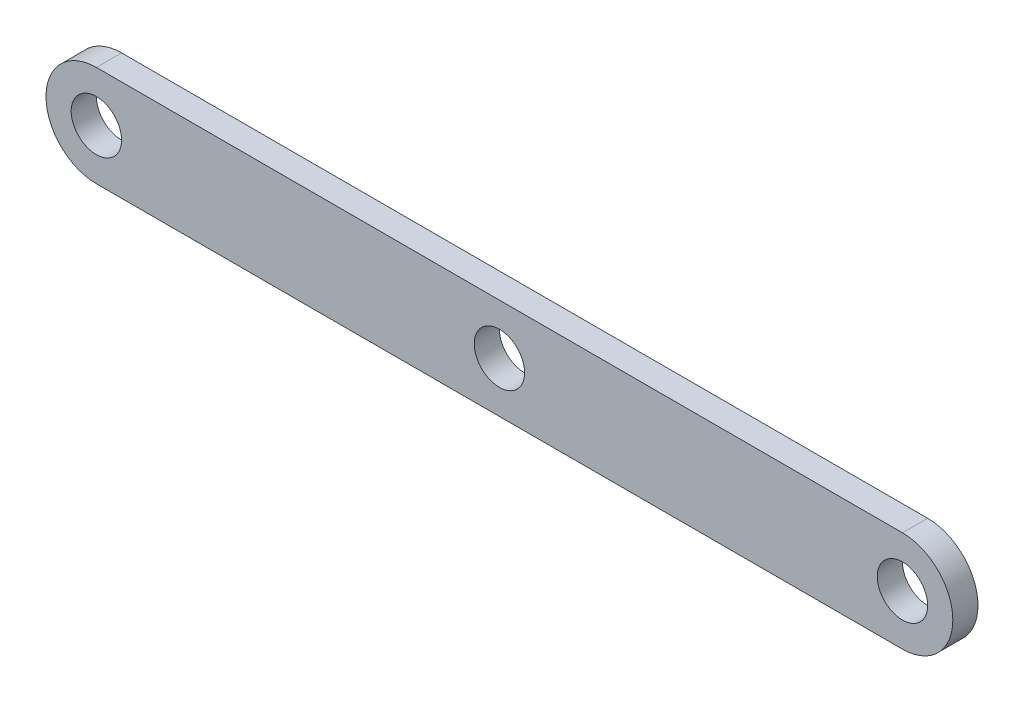
ISO-10303-21;
HEADER;
FILE_DESCRIPTION(('STEP AP214'),'2;1');
FILE_NAME('part.step','',(''),(''),'','','');
FILE_SCHEMA(('AUTOMOTIVE_DESIGN { 1 0 10303 214 1 1 1 1 }'));
ENDSEC;
DATA;
#1=APPLICATION_CONTEXT('core data for automotive mechanical design processes');
#2=APPLICATION_PROTOCOL_DEFINITION('international standard','automotive_design',2000,#1);
#3=PRODUCT_CONTEXT('',#1,'mechanical');
#4=PRODUCT('Part','Part','',(#3));
#5=PRODUCT_RELATED_PRODUCT_CATEGORY('part','',(#4));
#6=PRODUCT_DEFINITION_FORMATION('','',#4);
#7=PRODUCT_DEFINITION_CONTEXT('part definition',#1,'design');
#8=PRODUCT_DEFINITION('design','',#6,#7);
#9=PRODUCT_DEFINITION_SHAPE('','',#8);
#10=(LENGTH_UNIT() NAMED_UNIT(*) SI_UNIT(.MILLI.,.METRE.));
#11=(NAMED_UNIT(*) PLANE_ANGLE_UNIT() SI_UNIT($,.RADIAN.));
#12=(NAMED_UNIT(*) SI_UNIT($,.STERADIAN.) SOLID_ANGLE_UNIT());
#13=UNCERTAINTY_MEASURE_WITH_UNIT(LENGTH_MEASURE(1.E-05),#10,'distance_accuracy_value','');
#14=(GEOMETRIC_REPRESENTATION_CONTEXT(3) GLOBAL_UNCERTAINTY_ASSIGNED_CONTEXT((#13)) GLOBAL_UNIT_ASSIGNED_CONTEXT((#10,
#11,#12)) REPRESENTATION_CONTEXT('',''));
#15=CARTESIAN_POINT('',(0.,0.,0.));
#16=DIRECTION('',(0.,0.,1.));
#17=DIRECTION('',(1.,0.,0.));
#18=AXIS2_PLACEMENT_3D('',#15,#16,#17);
#19=CARTESIAN_POINT('',(0.,0.,3.175));
#20=DIRECTION('',(0.,0.,1.));
#21=DIRECTION('',(1.,0.,0.));
#22=AXIS2_PLACEMENT_3D('',#19,#20,#21);
#23=PLANE('',#22);
#24=CARTESIAN_POINT('',(101.6,0.,3.175));
#25=DIRECTION('',(0.,0.,1.));
#26=DIRECTION('',(1.,0.,0.));
#27=AXIS2_PLACEMENT_3D('',#24,#25,#26);
#28=CIRCLE('',#27,3.175);
#29=CARTESIAN_POINT('',(104.775,0.,3.175));
#30=VERTEX_POINT('',#29);
#31=EDGE_CURVE('E114',#30,#30,#28,.T.);
#32=ORIENTED_EDGE('',*,*,#31,.F.);
#33=EDGE_LOOP('',(#32));
#34=FACE_BOUND('',#33,.T.);
#35=CARTESIAN_POINT('',(0.,0.,3.175));
#36=DIRECTION('',(0.,0.,1.));
#37=DIRECTION('',(1.,0.,0.));
#38=AXIS2_PLACEMENT_3D('',#35,#36,#37);
#39=CIRCLE('',#38,6.35);
#40=CARTESIAN_POINT('',(0.,6.35,3.175));
#41=VERTEX_POINT('',#40);
#42=CARTESIAN_POINT('',(0.,-6.35,3.175));
#43=VERTEX_POINT('',#42);
#44=EDGE_CURVE('E84',#41,#43,#39,.T.);
#45=ORIENTED_EDGE('',*,*,#44,.T.);
#46=DIRECTION('',(1.,0.,0.));
#47=VECTOR('',#46,1.);
#48=CARTESIAN_POINT('',(0.,-6.35,3.175));
#49=LINE('',#48,#47);
#50=CARTESIAN_POINT('',(101.6,-6.35,3.175));
#51=VERTEX_POINT('',#50);
#52=EDGE_CURVE('E79',#43,#51,#49,.T.);
#53=ORIENTED_EDGE('',*,*,#52,.T.);
#54=CARTESIAN_POINT('',(101.6,0.,3.175));
#55=DIRECTION('',(0.,0.,1.));
#56=DIRECTION('',(1.,0.,0.));
#57=AXIS2_PLACEMENT_3D('',#54,#55,#56);
#58=CIRCLE('',#57,6.35);
#59=CARTESIAN_POINT('',(101.6,6.35,3.175));
#60=VERTEX_POINT('',#59);
#61=EDGE_CURVE('E82',#51,#60,#58,.T.);
#62=ORIENTED_EDGE('',*,*,#61,.T.);
#63=DIRECTION('',(-1.,0.,0.));
#64=VECTOR('',#63,1.);
#65=CARTESIAN_POINT('',(0.,6.35,3.175));
#66=LINE('',#65,#64);
#67=EDGE_CURVE('E49',#60,#41,#66,.T.);
#68=ORIENTED_EDGE('',*,*,#67,.T.);
#69=EDGE_LOOP('',(#45,#53,#62,#68));
#70=FACE_BOUND('',#69,.T.);
#71=CARTESIAN_POINT('',(0.,0.,3.175));
#72=DIRECTION('',(0.,0.,1.));
#73=DIRECTION('',(1.,0.,0.));
#74=AXIS2_PLACEMENT_3D('',#71,#72,#73);
#75=CIRCLE('',#74,3.175);
#76=CARTESIAN_POINT('',(3.175,0.,3.175));
#77=VERTEX_POINT('',#76);
#78=EDGE_CURVE('E99',#77,#77,#75,.T.);
#79=ORIENTED_EDGE('',*,*,#78,.F.);
#80=EDGE_LOOP('',(#79));
#81=FACE_BOUND('',#80,.T.);
#82=CARTESIAN_POINT('',(50.8,0.,3.175));
#83=DIRECTION('',(0.,0.,1.));
#84=DIRECTION('',(1.,0.,0.));
#85=AXIS2_PLACEMENT_3D('',#82,#83,#84);
#86=CIRCLE('',#85,3.175);
#87=CARTESIAN_POINT('',(53.975,0.,3.175));
#88=VERTEX_POINT('',#87);
#89=EDGE_CURVE('E120',#88,#88,#86,.T.);
#90=ORIENTED_EDGE('',*,*,#89,.F.);
#91=EDGE_LOOP('',(#90));
#92=FACE_BOUND('',#91,.T.);
#93=ADVANCED_FACE('F32',(#34,#70,#81,#92),#23,.T.);
#94=CARTESIAN_POINT('',(0.,0.,0.));
#95=DIRECTION('',(0.,0.,1.));
#96=DIRECTION('',(1.,0.,0.));
#97=AXIS2_PLACEMENT_3D('',#94,#95,#96);
#98=PLANE('',#97);
#99=CARTESIAN_POINT('',(101.6,0.,0.));
#100=DIRECTION('',(0.,0.,1.));
#101=DIRECTION('',(1.,0.,0.));
#102=AXIS2_PLACEMENT_3D('',#99,#100,#101);
#103=CIRCLE('',#102,3.175);
#104=CARTESIAN_POINT('',(104.775,0.,0.));
#105=VERTEX_POINT('',#104);
#106=EDGE_CURVE('E117',#105,#105,#103,.T.);
#107=ORIENTED_EDGE('',*,*,#106,.T.);
#108=EDGE_LOOP('',(#107));
#109=FACE_BOUND('',#108,.T.);
#110=CARTESIAN_POINT('',(0.,0.,0.));
#111=DIRECTION('',(0.,0.,1.));
#112=DIRECTION('',(1.,0.,0.));
#113=AXIS2_PLACEMENT_3D('',#110,#111,#112);
#114=CIRCLE('',#113,6.35);
#115=CARTESIAN_POINT('',(0.,6.35,0.));
#116=VERTEX_POINT('',#115);
#117=CARTESIAN_POINT('',(0.,-6.35,0.));
#118=VERTEX_POINT('',#117);
#119=EDGE_CURVE('E96',#116,#118,#114,.T.);
#120=ORIENTED_EDGE('',*,*,#119,.F.);
#121=DIRECTION('',(-1.,0.,0.));
#122=VECTOR('',#121,1.);
#123=CARTESIAN_POINT('',(0.,6.35,0.));
#124=LINE('',#123,#122);
#125=CARTESIAN_POINT('',(101.6,6.35,0.));
#126=VERTEX_POINT('',#125);
#127=EDGE_CURVE('E72',#126,#116,#124,.T.);
#128=ORIENTED_EDGE('',*,*,#127,.F.);
#129=CARTESIAN_POINT('',(101.6,0.,0.));
#130=DIRECTION('',(0.,0.,1.));
#131=DIRECTION('',(1.,0.,0.));
#132=AXIS2_PLACEMENT_3D('',#129,#130,#131);
#133=CIRCLE('',#132,6.35);
#134=CARTESIAN_POINT('',(101.6,-6.35,0.));
#135=VERTEX_POINT('',#134);
#136=EDGE_CURVE('E66',#135,#126,#133,.T.);
#137=ORIENTED_EDGE('',*,*,#136,.F.);
#138=DIRECTION('',(1.,0.,0.));
#139=VECTOR('',#138,1.);
#140=CARTESIAN_POINT('',(0.,-6.35,0.));
#141=LINE('',#140,#139);
#142=EDGE_CURVE('E88',#118,#135,#141,.T.);
#143=ORIENTED_EDGE('',*,*,#142,.F.);
#144=EDGE_LOOP('',(#120,#128,#137,#143));
#145=FACE_BOUND('',#144,.T.);
#146=CARTESIAN_POINT('',(0.,0.,0.));
#147=DIRECTION('',(0.,0.,1.));
#148=DIRECTION('',(1.,0.,0.));
#149=AXIS2_PLACEMENT_3D('',#146,#147,#148);
#150=CIRCLE('',#149,3.175);
#151=CARTESIAN_POINT('',(3.175,0.,0.));
#152=VERTEX_POINT('',#151);
#153=EDGE_CURVE('E111',#152,#152,#150,.T.);
#154=ORIENTED_EDGE('',*,*,#153,.T.);
#155=EDGE_LOOP('',(#154));
#156=FACE_BOUND('',#155,.T.);
#157=CARTESIAN_POINT('',(50.8,0.,0.));
#158=DIRECTION('',(0.,0.,1.));
#159=DIRECTION('',(1.,0.,0.));
#160=AXIS2_PLACEMENT_3D('',#157,#158,#159);
#161=CIRCLE('',#160,3.175);
#162=CARTESIAN_POINT('',(53.975,0.,0.));
#163=VERTEX_POINT('',#162);
#164=EDGE_CURVE('E123',#163,#163,#161,.T.);
#165=ORIENTED_EDGE('',*,*,#164,.T.);
#166=EDGE_LOOP('',(#165));
#167=FACE_BOUND('',#166,.T.);
#168=ADVANCED_FACE('F107',(#109,#145,#156,#167),#98,.F.);
#169=CARTESIAN_POINT('',(0.,0.,3.175));
#170=DIRECTION('',(0.,0.,-1.));
#171=DIRECTION('',(-1.,0.,0.));
#172=AXIS2_PLACEMENT_3D('',#169,#170,#171);
#173=CYLINDRICAL_SURFACE('',#172,6.35);
#174=ORIENTED_EDGE('',*,*,#119,.T.);
#175=DIRECTION('',(0.,0.,-1.));
#176=VECTOR('',#175,1.);
#177=CARTESIAN_POINT('',(0.,-6.35,3.175));
#178=LINE('',#177,#176);
#179=EDGE_CURVE('E11',#43,#118,#178,.T.);
#180=ORIENTED_EDGE('',*,*,#179,.F.);
#181=ORIENTED_EDGE('',*,*,#44,.F.);
#182=DIRECTION('',(0.,0.,-1.));
#183=VECTOR('',#182,1.);
#184=CARTESIAN_POINT('',(0.,6.35,3.175));
#185=LINE('',#184,#183);
#186=EDGE_CURVE('E92',#41,#116,#185,.T.);
#187=ORIENTED_EDGE('',*,*,#186,.T.);
#188=EDGE_LOOP('',(#174,#180,#181,#187));
#189=FACE_BOUND('',#188,.T.);
#190=ADVANCED_FACE('F34',(#189),#173,.T.);
#191=CARTESIAN_POINT('',(0.,-6.35,3.175));
#192=DIRECTION('',(0.,1.,0.));
#193=DIRECTION('',(0.,0.,1.));
#194=AXIS2_PLACEMENT_3D('',#191,#192,#193);
#195=PLANE('',#194);
#196=ORIENTED_EDGE('',*,*,#142,.T.);
#197=DIRECTION('',(0.,0.,-1.));
#198=VECTOR('',#197,1.);
#199=CARTESIAN_POINT('',(101.6,-6.35,3.175));
#200=LINE('',#199,#198);
#201=EDGE_CURVE('E41',#51,#135,#200,.T.);
#202=ORIENTED_EDGE('',*,*,#201,.F.);
#203=ORIENTED_EDGE('',*,*,#52,.F.);
#204=ORIENTED_EDGE('',*,*,#179,.T.);
#205=EDGE_LOOP('',(#196,#202,#203,#204));
#206=FACE_BOUND('',#205,.T.);
#207=ADVANCED_FACE('F87',(#206),#195,.F.);
#208=CARTESIAN_POINT('',(101.6,0.,3.175));
#209=DIRECTION('',(0.,0.,-1.));
#210=DIRECTION('',(-1.,0.,0.));
#211=AXIS2_PLACEMENT_3D('',#208,#209,#210);
#212=CYLINDRICAL_SURFACE('',#211,6.35);
#213=ORIENTED_EDGE('',*,*,#136,.T.);
#214=DIRECTION('',(0.,0.,-1.));
#215=VECTOR('',#214,1.);
#216=CARTESIAN_POINT('',(101.6,6.35,3.175));
#217=LINE('',#216,#215);
#218=EDGE_CURVE('E89',#60,#126,#217,.T.);
#219=ORIENTED_EDGE('',*,*,#218,.F.);
#220=ORIENTED_EDGE('',*,*,#61,.F.);
#221=ORIENTED_EDGE('',*,*,#201,.T.);
#222=EDGE_LOOP('',(#213,#219,#220,#221));
#223=FACE_BOUND('',#222,.T.);
#224=ADVANCED_FACE('F90',(#223),#212,.T.);
#225=CARTESIAN_POINT('',(0.,6.35,3.175));
#226=DIRECTION('',(0.,-1.,0.));
#227=DIRECTION('',(0.,0.,-1.));
#228=AXIS2_PLACEMENT_3D('',#225,#226,#227);
#229=PLANE('',#228);
#230=ORIENTED_EDGE('',*,*,#127,.T.);
#231=ORIENTED_EDGE('',*,*,#186,.F.);
#232=ORIENTED_EDGE('',*,*,#67,.F.);
#233=ORIENTED_EDGE('',*,*,#218,.T.);
#234=EDGE_LOOP('',(#230,#231,#232,#233));
#235=FACE_BOUND('',#234,.T.);
#236=ADVANCED_FACE('F104',(#235),#229,.F.);
#237=CARTESIAN_POINT('',(0.,0.,3.175));
#238=DIRECTION('',(0.,0.,-1.));
#239=DIRECTION('',(-1.,0.,0.));
#240=AXIS2_PLACEMENT_3D('',#237,#238,#239);
#241=CYLINDRICAL_SURFACE('',#240,3.175);
#242=ORIENTED_EDGE('',*,*,#78,.T.);
#243=EDGE_LOOP('',(#242));
#244=FACE_BOUND('',#243,.T.);
#245=ORIENTED_EDGE('',*,*,#153,.F.);
#246=EDGE_LOOP('',(#245));
#247=FACE_BOUND('',#246,.T.);
#248=ADVANCED_FACE('F142',(#244,#247),#241,.F.);
#249=CARTESIAN_POINT('',(101.6,0.,3.175));
#250=DIRECTION('',(0.,0.,-1.));
#251=DIRECTION('',(-1.,0.,0.));
#252=AXIS2_PLACEMENT_3D('',#249,#250,#251);
#253=CYLINDRICAL_SURFACE('',#252,3.175);
#254=ORIENTED_EDGE('',*,*,#31,.T.);
#255=EDGE_LOOP('',(#254));
#256=FACE_BOUND('',#255,.T.);
#257=ORIENTED_EDGE('',*,*,#106,.F.);
#258=EDGE_LOOP('',(#257));
#259=FACE_BOUND('',#258,.T.);
#260=ADVANCED_FACE('F188',(#256,#259),#253,.F.);
#261=CARTESIAN_POINT('',(50.8,0.,3.175));
#262=DIRECTION('',(0.,0.,-1.));
#263=DIRECTION('',(-1.,0.,0.));
#264=AXIS2_PLACEMENT_3D('',#261,#262,#263);
#265=CYLINDRICAL_SURFACE('',#264,3.175);
#266=ORIENTED_EDGE('',*,*,#89,.T.);
#267=EDGE_LOOP('',(#266));
#268=FACE_BOUND('',#267,.T.);
#269=ORIENTED_EDGE('',*,*,#164,.F.);
#270=EDGE_LOOP('',(#269));
#271=FACE_BOUND('',#270,.T.);
#272=ADVANCED_FACE('F129',(#268,#271),#265,.F.);
#273=CLOSED_SHELL('',(#93,#168,#190,#207,#224,#236,#248,#260,#272));
#274=MANIFOLD_SOLID_BREP('B2',#273);
#275=ADVANCED_BREP_SHAPE_REPRESENTATION('',(#18,#274),#14);
#276=SHAPE_DEFINITION_REPRESENTATION(#9,#275);
ENDSEC;
END-ISO-10303-21;
